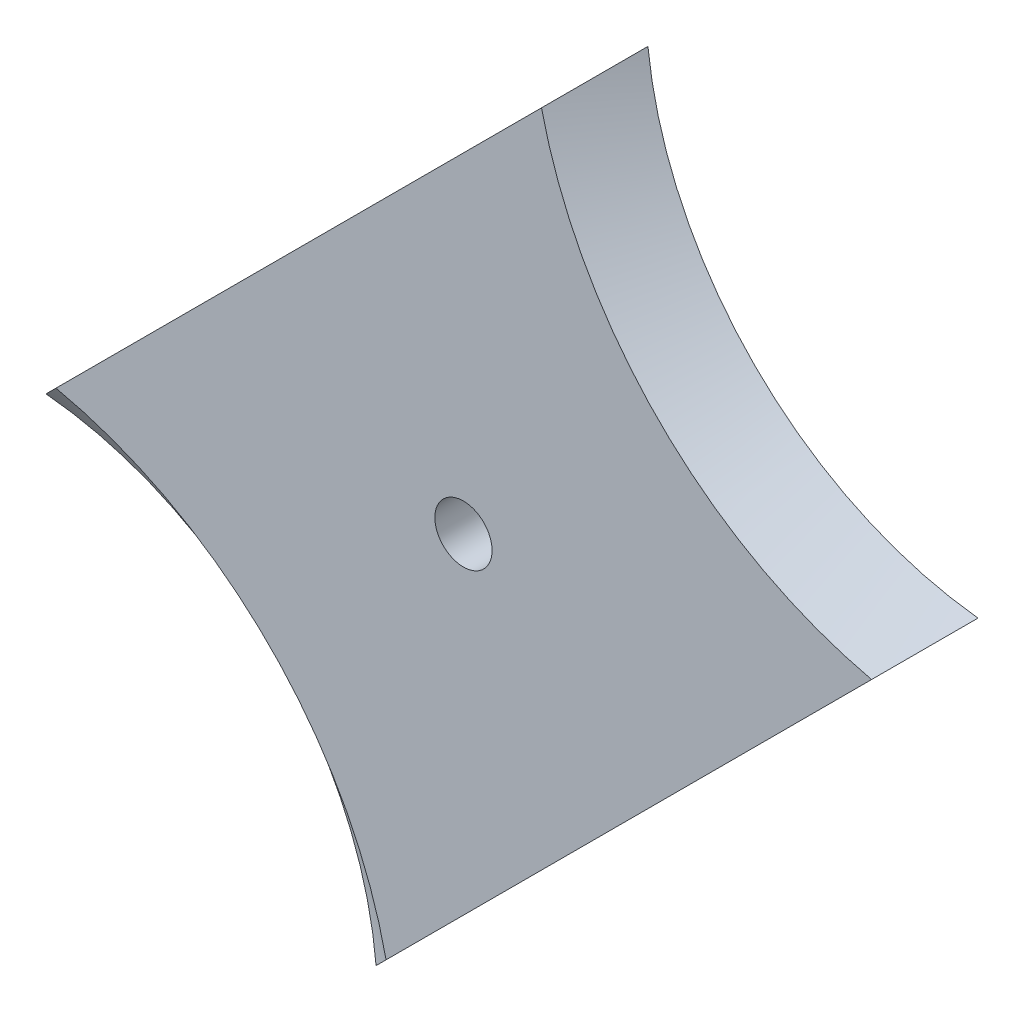
ISO-10303-21;
HEADER;
FILE_DESCRIPTION(('STEP AP214'),'2;1');
FILE_NAME('part.step','',(''),(''),'','','');
FILE_SCHEMA(('AUTOMOTIVE_DESIGN { 1 0 10303 214 1 1 1 1 }'));
ENDSEC;
DATA;
#1=APPLICATION_CONTEXT('core data for automotive mechanical design processes');
#2=APPLICATION_PROTOCOL_DEFINITION('international standard','automotive_design',2000,#1);
#3=PRODUCT_CONTEXT('',#1,'mechanical');
#4=PRODUCT('Part','Part','',(#3));
#5=PRODUCT_RELATED_PRODUCT_CATEGORY('part','',(#4));
#6=PRODUCT_DEFINITION_FORMATION('','',#4);
#7=PRODUCT_DEFINITION_CONTEXT('part definition',#1,'design');
#8=PRODUCT_DEFINITION('design','',#6,#7);
#9=PRODUCT_DEFINITION_SHAPE('','',#8);
#10=(LENGTH_UNIT() NAMED_UNIT(*) SI_UNIT(.MILLI.,.METRE.));
#11=(NAMED_UNIT(*) PLANE_ANGLE_UNIT() SI_UNIT($,.RADIAN.));
#12=(NAMED_UNIT(*) SI_UNIT($,.STERADIAN.) SOLID_ANGLE_UNIT());
#13=UNCERTAINTY_MEASURE_WITH_UNIT(LENGTH_MEASURE(1.E-05),#10,'distance_accuracy_value','');
#14=(GEOMETRIC_REPRESENTATION_CONTEXT(3) GLOBAL_UNCERTAINTY_ASSIGNED_CONTEXT((#13)) GLOBAL_UNIT_ASSIGNED_CONTEXT((#10,
#11,#12)) REPRESENTATION_CONTEXT('',''));
#15=CARTESIAN_POINT('',(0.,0.,0.));
#16=DIRECTION('',(0.,0.,1.));
#17=DIRECTION('',(1.,0.,0.));
#18=AXIS2_PLACEMENT_3D('',#15,#16,#17);
#19=CARTESIAN_POINT('',(-10.630505293205,10.6305052932055,5.));
#20=DIRECTION('',(0.707106781186529,-0.707106781186566,0.));
#21=DIRECTION('',(0.707106781186566,0.707106781186529,0.));
#22=AXIS2_PLACEMENT_3D('',#19,#20,#21);
#23=PLANE('',#22);
#24=DIRECTION('',(-0.707106781186566,-0.707106781186529,0.));
#25=VECTOR('',#24,1.);
#26=CARTESIAN_POINT('',(-10.630505293205,10.6305052932055,5.));
#27=LINE('',#26,#25);
#28=CARTESIAN_POINT('',(138.605172723639,159.866183310041,5.));
#29=VERTEX_POINT('',#28);
#30=CARTESIAN_POINT('',(88.5969085061941,109.857919092599,5.));
#31=VERTEX_POINT('',#30);
#32=EDGE_CURVE('E190',#29,#31,#27,.T.);
#33=ORIENTED_EDGE('',*,*,#32,.T.);
#34=CARTESIAN_POINT('',(88.5969085061941,109.857919092599,5.));
#35=CARTESIAN_POINT('',(88.0997413170721,109.360751903477,4.57065043121903));
#36=CARTESIAN_POINT('',(87.6014684048836,108.862478991289,4.14384625426405));
#37=CARTESIAN_POINT('',(86.6024327031771,107.863443289582,3.29626509323985));
#38=CARTESIAN_POINT('',(86.1016701590663,107.362680745472,2.87548753038534));
#39=CARTESIAN_POINT('',(85.0972691207709,106.358279707176,2.0408029716374));
#40=CARTESIAN_POINT('',(84.593630560283,105.854641146688,1.6268961350073));
#41=CARTESIAN_POINT('',(83.5830325889892,104.844043175395,0.80711478020677));
#42=CARTESIAN_POINT('',(83.0760728613121,104.337083447718,0.401241043775979));
#43=CARTESIAN_POINT('',(82.567273067566,103.828283653972,0.));
#44=B_SPLINE_CURVE_WITH_KNOTS('',3,(#34,#35,#36,#37,#38,#39,#40,#41,#42,#43),.UNSPECIFIED.,.F.,
.F.,(4,2,2,2,4),(0.,2.47148799400065,4.94273701725223,7.41404324425134,9.88558879507614),.UNSPECIFIED.);
#45=CARTESIAN_POINT('',(82.567273067566,103.828283653972,0.));
#46=VERTEX_POINT('',#45);
#47=EDGE_CURVE('E11',#31,#46,#44,.T.);
#48=ORIENTED_EDGE('',*,*,#47,.T.);
#49=DIRECTION('',(-0.707106781186566,-0.707106781186529,0.));
#50=VECTOR('',#49,1.);
#51=CARTESIAN_POINT('',(-10.630505293205,10.6305052932055,0.));
#52=LINE('',#51,#50);
#53=CARTESIAN_POINT('',(144.567273067569,165.828283653971,0.));
#54=VERTEX_POINT('',#53);
#55=EDGE_CURVE('E87',#54,#46,#52,.T.);
#56=ORIENTED_EDGE('',*,*,#55,.F.);
#57=CARTESIAN_POINT('',(144.567273067569,165.828283653971,0.));
#58=CARTESIAN_POINT('',(144.064610980134,165.325621566537,0.402654644069307));
#59=CARTESIAN_POINT('',(143.563637207193,164.824647793595,0.809497303374607));
#60=CARTESIAN_POINT('',(142.564739058922,163.825749645324,1.63047357891199));
#61=CARTESIAN_POINT('',(142.066814436423,163.327825022826,2.04460659334178));
#62=CARTESIAN_POINT('',(141.073614408614,162.334624995016,2.87913700990058));
#63=CARTESIAN_POINT('',(140.578338952639,161.839349539042,3.2995342916417));
#64=CARTESIAN_POINT('',(139.590091615706,160.851102202109,4.14584038799011));
#65=CARTESIAN_POINT('',(139.097119927115,160.358130513518,4.57174965204425));
#66=CARTESIAN_POINT('',(138.605172723639,159.866183310041,5.));
#67=B_SPLINE_CURVE_WITH_KNOTS('',3,(#57,#58,#59,#60,#61,#62,#63,#64,#65,#66),.UNSPECIFIED.,.F.,
.F.,(4,2,2,2,4),(0.,2.45092995327904,4.90165852783568,7.35234006441152,9.80322270452902),.UNSPECIFIED.);
#68=EDGE_CURVE('E95',#54,#29,#67,.T.);
#69=ORIENTED_EDGE('',*,*,#68,.T.);
#70=EDGE_LOOP('',(#33,#48,#56,#69));
#71=FACE_BOUND('',#70,.T.);
#72=ADVANCED_FACE('F36',(#71),#23,.T.);
#73=CARTESIAN_POINT('',(-44.6305052931984,44.6305052932007,5.));
#74=DIRECTION('',(-0.707106781186529,0.707106781186566,0.));
#75=DIRECTION('',(-0.707106781186566,-0.707106781186529,0.));
#76=AXIS2_PLACEMENT_3D('',#73,#74,#75);
#77=PLANE('',#76);
#78=DIRECTION('',(0.707106781186566,0.707106781186529,0.));
#79=VECTOR('',#78,1.);
#80=CARTESIAN_POINT('',(-44.6305052931984,44.6305052932007,0.));
#81=LINE('',#80,#79);
#82=CARTESIAN_POINT('',(48.5672730675726,137.828283653967,0.));
#83=VERTEX_POINT('',#82);
#84=CARTESIAN_POINT('',(110.567273067575,199.828283653966,0.));
#85=VERTEX_POINT('',#84);
#86=EDGE_CURVE('E89',#83,#85,#81,.T.);
#87=ORIENTED_EDGE('',*,*,#86,.F.);
#88=CARTESIAN_POINT('',(48.5672730675726,137.828283653967,0.));
#89=CARTESIAN_POINT('',(49.0760728613187,138.337083447713,0.401241043775988));
#90=CARTESIAN_POINT('',(49.5830325889958,138.84404317539,0.807114780206778));
#91=CARTESIAN_POINT('',(50.5936305602895,139.854641146684,1.62689613500731));
#92=CARTESIAN_POINT('',(51.0972691207775,140.358279707172,2.04080297163741));
#93=CARTESIAN_POINT('',(52.1016701590729,141.362680745467,2.87548753038535));
#94=CARTESIAN_POINT('',(52.6024327031837,141.863443289578,3.29626509323987));
#95=CARTESIAN_POINT('',(53.6014684048902,142.862478991284,4.14384625426406));
#96=CARTESIAN_POINT('',(54.0997413170786,143.360751903473,4.57065043121904));
#97=CARTESIAN_POINT('',(54.5969085062007,143.857919092595,5.00000000000001));
#98=B_SPLINE_CURVE_WITH_KNOTS('',3,(#88,#89,#90,#91,#92,#93,#94,#95,#96,#97),.UNSPECIFIED.,.F.,
.F.,(4,2,2,2,4),(0.,2.4715455508248,4.94285177782394,7.41410080107551,9.88558879507615),.UNSPECIFIED.);
#99=CARTESIAN_POINT('',(54.5969085062007,143.857919092595,5.));
#100=VERTEX_POINT('',#99);
#101=EDGE_CURVE('E64',#83,#100,#98,.T.);
#102=ORIENTED_EDGE('',*,*,#101,.T.);
#103=DIRECTION('',(0.707106781186566,0.707106781186529,0.));
#104=VECTOR('',#103,1.);
#105=CARTESIAN_POINT('',(-44.6305052931984,44.6305052932007,5.));
#106=LINE('',#105,#104);
#107=CARTESIAN_POINT('',(104.605172723645,193.866183310037,5.));
#108=VERTEX_POINT('',#107);
#109=EDGE_CURVE('E193',#100,#108,#106,.T.);
#110=ORIENTED_EDGE('',*,*,#109,.T.);
#111=CARTESIAN_POINT('',(104.605172723645,193.866183310037,5.));
#112=CARTESIAN_POINT('',(105.097119927122,194.358130513513,4.57174965204425));
#113=CARTESIAN_POINT('',(105.590091615713,194.851102202104,4.14584038799011));
#114=CARTESIAN_POINT('',(106.578338952646,195.839349539037,3.29953429164171));
#115=CARTESIAN_POINT('',(107.07361440862,196.334624995012,2.87913700990059));
#116=CARTESIAN_POINT('',(108.06681443643,197.327825022821,2.04460659334179));
#117=CARTESIAN_POINT('',(108.564739058928,197.82574964532,1.63047357891199));
#118=CARTESIAN_POINT('',(109.563637207199,198.82464779359,0.809497303374603));
#119=CARTESIAN_POINT('',(110.064610980141,199.325621566532,0.402654644069304));
#120=CARTESIAN_POINT('',(110.567273067575,199.828283653966,0.));
#121=B_SPLINE_CURVE_WITH_KNOTS('',3,(#111,#112,#113,#114,#115,#116,#117,#118,#119,#120),
.UNSPECIFIED.,.F.,.F.,(4,2,2,2,4),(0.,2.45088264011751,4.90156417669334,7.35229275124998,
9.80322270452903),.UNSPECIFIED.);
#122=EDGE_CURVE('E103',#108,#85,#121,.T.);
#123=ORIENTED_EDGE('',*,*,#122,.T.);
#124=EDGE_LOOP('',(#87,#102,#110,#123));
#125=FACE_BOUND('',#124,.T.);
#126=ADVANCED_FACE('F129',(#125),#77,.T.);
#127=CARTESIAN_POINT('',(96.5672730675705,151.828283653969,5.));
#128=DIRECTION('',(0.,0.,-1.));
#129=DIRECTION('',(-1.,0.,0.));
#130=AXIS2_PLACEMENT_3D('',#127,#128,#129);
#131=CYLINDRICAL_SURFACE('',#130,2.94685624032715);
#132=CARTESIAN_POINT('',(96.5672730675705,151.828283653969,5.));
#133=DIRECTION('',(0.,0.,1.));
#134=DIRECTION('',(1.,0.,0.));
#135=AXIS2_PLACEMENT_3D('',#132,#133,#134);
#136=CIRCLE('',#135,2.94685624032715);
#137=CARTESIAN_POINT('',(99.5141293078977,151.828283653969,5.));
#138=VERTEX_POINT('',#137);
#139=EDGE_CURVE('E188',#138,#138,#136,.T.);
#140=ORIENTED_EDGE('',*,*,#139,.T.);
#141=EDGE_LOOP('',(#140));
#142=FACE_BOUND('',#141,.T.);
#143=CARTESIAN_POINT('',(96.5672730675705,151.828283653969,0.));
#144=DIRECTION('',(0.,0.,1.));
#145=DIRECTION('',(1.,0.,0.));
#146=AXIS2_PLACEMENT_3D('',#143,#144,#145);
#147=CIRCLE('',#146,2.94685624032715);
#148=CARTESIAN_POINT('',(99.5141293078977,151.828283653969,0.));
#149=VERTEX_POINT('',#148);
#150=EDGE_CURVE('E97',#149,#149,#147,.T.);
#151=ORIENTED_EDGE('',*,*,#150,.F.);
#152=EDGE_LOOP('',(#151));
#153=FACE_BOUND('',#152,.T.);
#154=ADVANCED_FACE('F125',(#142,#153),#131,.F.);
#155=CARTESIAN_POINT('',(0.,0.,5.));
#156=DIRECTION('',(0.,0.,1.));
#157=DIRECTION('',(1.,0.,0.));
#158=AXIS2_PLACEMENT_3D('',#155,#156,#157);
#159=PLANE('',#158);
#160=ORIENTED_EDGE('',*,*,#139,.F.);
#161=EDGE_LOOP('',(#160));
#162=FACE_BOUND('',#161,.T.);
#163=ORIENTED_EDGE('',*,*,#109,.F.);
#164=CARTESIAN_POINT('',(45.2197074952692,100.48071808167,5.));
#165=DIRECTION('',(0.,0.,1.));
#166=DIRECTION('',(1.,0.,0.));
#167=AXIS2_PLACEMENT_3D('',#164,#165,#166);
#168=CIRCLE('',#167,44.3792008303615);
#169=EDGE_CURVE('E50',#100,#31,#168,.F.);
#170=ORIENTED_EDGE('',*,*,#169,.T.);
#171=ORIENTED_EDGE('',*,*,#32,.F.);
#172=CARTESIAN_POINT('',(148.724310559712,203.985321146108,5.));
#173=DIRECTION('',(0.,0.,1.));
#174=DIRECTION('',(1.,0.,0.));
#175=AXIS2_PLACEMENT_3D('',#172,#173,#174);
#176=CIRCLE('',#175,45.2647243882391);
#177=EDGE_CURVE('E102',#29,#108,#176,.F.);
#178=ORIENTED_EDGE('',*,*,#177,.T.);
#179=EDGE_LOOP('',(#163,#170,#171,#178));
#180=FACE_BOUND('',#179,.T.);
#181=ADVANCED_FACE('F128',(#162,#180),#159,.T.);
#182=CARTESIAN_POINT('',(0.,0.,0.));
#183=DIRECTION('',(0.,0.,1.));
#184=DIRECTION('',(1.,0.,0.));
#185=AXIS2_PLACEMENT_3D('',#182,#183,#184);
#186=PLANE('',#185);
#187=ORIENTED_EDGE('',*,*,#150,.T.);
#188=EDGE_LOOP('',(#187));
#189=FACE_BOUND('',#188,.T.);
#190=ORIENTED_EDGE('',*,*,#55,.T.);
#191=CARTESIAN_POINT('',(45.2197074952692,100.48071808167,0.));
#192=DIRECTION('',(0.,0.,1.));
#193=DIRECTION('',(1.,0.,0.));
#194=AXIS2_PLACEMENT_3D('',#191,#192,#193);
#195=CIRCLE('',#194,37.4972912280056);
#196=EDGE_CURVE('E187',#46,#83,#195,.T.);
#197=ORIENTED_EDGE('',*,*,#196,.T.);
#198=ORIENTED_EDGE('',*,*,#86,.T.);
#199=CARTESIAN_POINT('',(148.724310559712,203.985321146108,0.));
#200=DIRECTION('',(0.,0.,1.));
#201=DIRECTION('',(1.,0.,0.));
#202=AXIS2_PLACEMENT_3D('',#199,#200,#201);
#203=CIRCLE('',#202,38.3828147858832);
#204=EDGE_CURVE('E83',#54,#85,#203,.F.);
#205=ORIENTED_EDGE('',*,*,#204,.F.);
#206=EDGE_LOOP('',(#190,#197,#198,#205));
#207=FACE_BOUND('',#206,.T.);
#208=ADVANCED_FACE('F85',(#189,#207),#186,.F.);
#209=CARTESIAN_POINT('',(148.724310559712,203.985321146108,5.));
#210=DIRECTION('',(0.,0.,1.));
#211=DIRECTION('',(1.,0.,0.));
#212=AXIS2_PLACEMENT_3D('',#209,#210,#211);
#213=CONICAL_SURFACE('',#212,45.2647243882391,0.942477796076938);
#214=ORIENTED_EDGE('',*,*,#68,.F.);
#215=ORIENTED_EDGE('',*,*,#204,.T.);
#216=ORIENTED_EDGE('',*,*,#122,.F.);
#217=ORIENTED_EDGE('',*,*,#177,.F.);
#218=EDGE_LOOP('',(#214,#215,#216,#217));
#219=FACE_BOUND('',#218,.T.);
#220=ADVANCED_FACE('F100',(#219),#213,.F.);
#221=CARTESIAN_POINT('',(45.2197074952692,100.48071808167,0.));
#222=DIRECTION('',(0.,0.,1.));
#223=DIRECTION('',(1.,0.,0.));
#224=AXIS2_PLACEMENT_3D('',#221,#222,#223);
#225=CONICAL_SURFACE('',#224,37.4972912280056,0.942477796076938);
#226=ORIENTED_EDGE('',*,*,#47,.F.);
#227=ORIENTED_EDGE('',*,*,#169,.F.);
#228=ORIENTED_EDGE('',*,*,#101,.F.);
#229=ORIENTED_EDGE('',*,*,#196,.F.);
#230=EDGE_LOOP('',(#226,#227,#228,#229));
#231=FACE_BOUND('',#230,.T.);
#232=ADVANCED_FACE('F38',(#231),#225,.F.);
#233=CLOSED_SHELL('',(#72,#126,#154,#181,#208,#220,#232));
#234=MANIFOLD_SOLID_BREP('B2',#233);
#235=ADVANCED_BREP_SHAPE_REPRESENTATION('',(#18,#234),#14);
#236=SHAPE_DEFINITION_REPRESENTATION(#9,#235);
ENDSEC;
END-ISO-10303-21;
